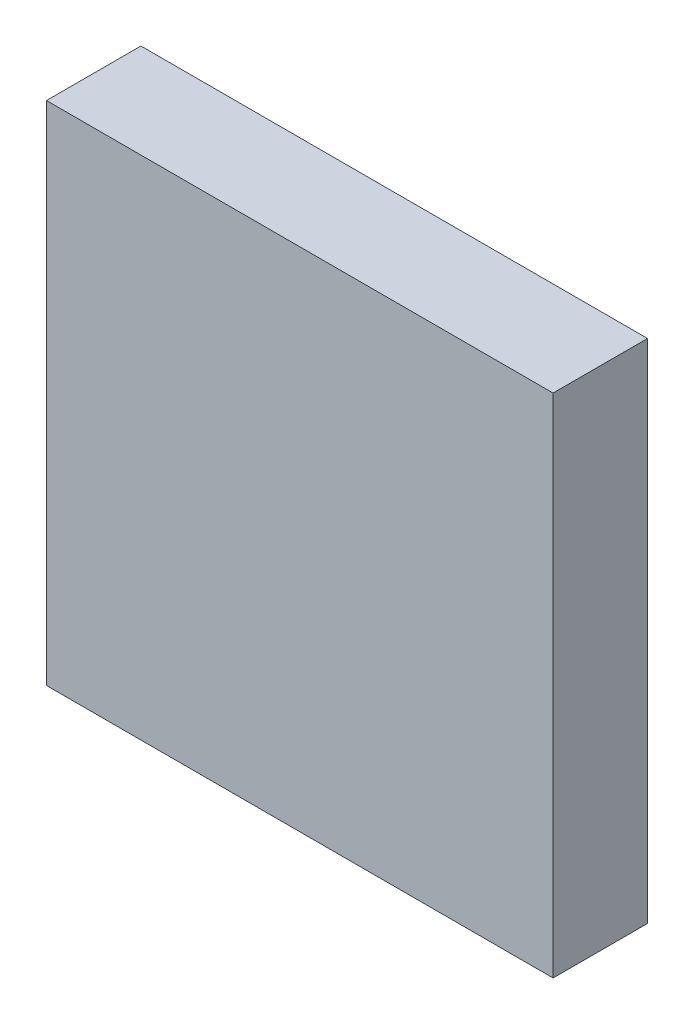
ISO-10303-21;
HEADER;
FILE_DESCRIPTION(('STEP AP214'),'2;1');
FILE_NAME('part.step','',(''),(''),'','','');
FILE_SCHEMA(('AUTOMOTIVE_DESIGN { 1 0 10303 214 1 1 1 1 }'));
ENDSEC;
DATA;
#1=APPLICATION_CONTEXT('core data for automotive mechanical design processes');
#2=APPLICATION_PROTOCOL_DEFINITION('international standard','automotive_design',2000,#1);
#3=PRODUCT_CONTEXT('',#1,'mechanical');
#4=PRODUCT('Part','Part','',(#3));
#5=PRODUCT_RELATED_PRODUCT_CATEGORY('part','',(#4));
#6=PRODUCT_DEFINITION_FORMATION('','',#4);
#7=PRODUCT_DEFINITION_CONTEXT('part definition',#1,'design');
#8=PRODUCT_DEFINITION('design','',#6,#7);
#9=PRODUCT_DEFINITION_SHAPE('','',#8);
#10=(LENGTH_UNIT() NAMED_UNIT(*) SI_UNIT(.MILLI.,.METRE.));
#11=(NAMED_UNIT(*) PLANE_ANGLE_UNIT() SI_UNIT($,.RADIAN.));
#12=(NAMED_UNIT(*) SI_UNIT($,.STERADIAN.) SOLID_ANGLE_UNIT());
#13=UNCERTAINTY_MEASURE_WITH_UNIT(LENGTH_MEASURE(1.E-05),#10,'distance_accuracy_value','');
#14=(GEOMETRIC_REPRESENTATION_CONTEXT(3) GLOBAL_UNCERTAINTY_ASSIGNED_CONTEXT((#13)) GLOBAL_UNIT_ASSIGNED_CONTEXT((#10,
#11,#12)) REPRESENTATION_CONTEXT('',''));
#15=CARTESIAN_POINT('',(0.,0.,0.));
#16=DIRECTION('',(0.,0.,1.));
#17=DIRECTION('',(1.,0.,0.));
#18=AXIS2_PLACEMENT_3D('',#15,#16,#17);
#19=CARTESIAN_POINT('',(-2.95,2.95,0.));
#20=DIRECTION('',(0.,1.,0.));
#21=DIRECTION('',(1.,0.,0.));
#22=AXIS2_PLACEMENT_3D('',#19,#20,#21);
#23=PLANE('',#22);
#24=DIRECTION('',(0.,0.,1.));
#25=VECTOR('',#24,1.);
#26=CARTESIAN_POINT('',(-2.95,2.95,0.));
#27=LINE('',#26,#25);
#28=CARTESIAN_POINT('',(-2.95,2.95,0.));
#29=VERTEX_POINT('',#28);
#30=CARTESIAN_POINT('',(-2.95,2.95,1.1));
#31=VERTEX_POINT('',#30);
#32=EDGE_CURVE('E11',#29,#31,#27,.T.);
#33=ORIENTED_EDGE('',*,*,#32,.T.);
#34=DIRECTION('',(1.,0.,0.));
#35=VECTOR('',#34,1.);
#36=CARTESIAN_POINT('',(-2.95,2.95,1.1));
#37=LINE('',#36,#35);
#38=CARTESIAN_POINT('',(2.95,2.95,1.1));
#39=VERTEX_POINT('',#38);
#40=EDGE_CURVE('E24',#31,#39,#37,.T.);
#41=ORIENTED_EDGE('',*,*,#40,.T.);
#42=DIRECTION('',(0.,0.,1.));
#43=VECTOR('',#42,1.);
#44=CARTESIAN_POINT('',(2.95,2.95,0.));
#45=LINE('',#44,#43);
#46=CARTESIAN_POINT('',(2.95,2.95,0.));
#47=VERTEX_POINT('',#46);
#48=EDGE_CURVE('E85',#47,#39,#45,.T.);
#49=ORIENTED_EDGE('',*,*,#48,.F.);
#50=DIRECTION('',(1.,0.,0.));
#51=VECTOR('',#50,1.);
#52=CARTESIAN_POINT('',(-2.95,2.95,0.));
#53=LINE('',#52,#51);
#54=EDGE_CURVE('E83',#29,#47,#53,.T.);
#55=ORIENTED_EDGE('',*,*,#54,.F.);
#56=EDGE_LOOP('',(#33,#41,#49,#55));
#57=FACE_BOUND('',#56,.T.);
#58=ADVANCED_FACE('F17',(#57),#23,.T.);
#59=CARTESIAN_POINT('',(2.95,2.95,0.));
#60=DIRECTION('',(1.,0.,0.));
#61=DIRECTION('',(0.,-1.,0.));
#62=AXIS2_PLACEMENT_3D('',#59,#60,#61);
#63=PLANE('',#62);
#64=ORIENTED_EDGE('',*,*,#48,.T.);
#65=DIRECTION('',(0.,-1.,0.));
#66=VECTOR('',#65,1.);
#67=CARTESIAN_POINT('',(2.95,2.95,1.1));
#68=LINE('',#67,#66);
#69=CARTESIAN_POINT('',(2.95,-2.95,1.1));
#70=VERTEX_POINT('',#69);
#71=EDGE_CURVE('E81',#39,#70,#68,.T.);
#72=ORIENTED_EDGE('',*,*,#71,.T.);
#73=DIRECTION('',(0.,0.,1.));
#74=VECTOR('',#73,1.);
#75=CARTESIAN_POINT('',(2.95,-2.95,0.));
#76=LINE('',#75,#74);
#77=CARTESIAN_POINT('',(2.95,-2.95,0.));
#78=VERTEX_POINT('',#77);
#79=EDGE_CURVE('E79',#78,#70,#76,.T.);
#80=ORIENTED_EDGE('',*,*,#79,.F.);
#81=DIRECTION('',(0.,-1.,0.));
#82=VECTOR('',#81,1.);
#83=CARTESIAN_POINT('',(2.95,2.95,0.));
#84=LINE('',#83,#82);
#85=EDGE_CURVE('E70',#47,#78,#84,.T.);
#86=ORIENTED_EDGE('',*,*,#85,.F.);
#87=EDGE_LOOP('',(#64,#72,#80,#86));
#88=FACE_BOUND('',#87,.T.);
#89=ADVANCED_FACE('F90',(#88),#63,.T.);
#90=CARTESIAN_POINT('',(2.95,-2.95,0.));
#91=DIRECTION('',(0.,-1.,0.));
#92=DIRECTION('',(-1.,0.,0.));
#93=AXIS2_PLACEMENT_3D('',#90,#91,#92);
#94=PLANE('',#93);
#95=ORIENTED_EDGE('',*,*,#79,.T.);
#96=DIRECTION('',(-1.,0.,0.));
#97=VECTOR('',#96,1.);
#98=CARTESIAN_POINT('',(2.95,-2.95,1.1));
#99=LINE('',#98,#97);
#100=CARTESIAN_POINT('',(-2.95,-2.95,1.1));
#101=VERTEX_POINT('',#100);
#102=EDGE_CURVE('E60',#70,#101,#99,.T.);
#103=ORIENTED_EDGE('',*,*,#102,.T.);
#104=DIRECTION('',(0.,0.,1.));
#105=VECTOR('',#104,1.);
#106=CARTESIAN_POINT('',(-2.95,-2.95,0.));
#107=LINE('',#106,#105);
#108=CARTESIAN_POINT('',(-2.95,-2.95,0.));
#109=VERTEX_POINT('',#108);
#110=EDGE_CURVE('E54',#109,#101,#107,.T.);
#111=ORIENTED_EDGE('',*,*,#110,.F.);
#112=DIRECTION('',(-1.,0.,0.));
#113=VECTOR('',#112,1.);
#114=CARTESIAN_POINT('',(2.95,-2.95,0.));
#115=LINE('',#114,#113);
#116=EDGE_CURVE('E58',#78,#109,#115,.T.);
#117=ORIENTED_EDGE('',*,*,#116,.F.);
#118=EDGE_LOOP('',(#95,#103,#111,#117));
#119=FACE_BOUND('',#118,.T.);
#120=ADVANCED_FACE('F57',(#119),#94,.T.);
#121=CARTESIAN_POINT('',(-2.95,-2.95,0.));
#122=DIRECTION('',(-1.,0.,0.));
#123=DIRECTION('',(0.,1.,0.));
#124=AXIS2_PLACEMENT_3D('',#121,#122,#123);
#125=PLANE('',#124);
#126=ORIENTED_EDGE('',*,*,#110,.T.);
#127=DIRECTION('',(0.,1.,0.));
#128=VECTOR('',#127,1.);
#129=CARTESIAN_POINT('',(-2.95,-2.95,1.1));
#130=LINE('',#129,#128);
#131=EDGE_CURVE('E71',#101,#31,#130,.T.);
#132=ORIENTED_EDGE('',*,*,#131,.T.);
#133=ORIENTED_EDGE('',*,*,#32,.F.);
#134=DIRECTION('',(0.,1.,0.));
#135=VECTOR('',#134,1.);
#136=CARTESIAN_POINT('',(-2.95,-2.95,0.));
#137=LINE('',#136,#135);
#138=EDGE_CURVE('E68',#109,#29,#137,.T.);
#139=ORIENTED_EDGE('',*,*,#138,.F.);
#140=EDGE_LOOP('',(#126,#132,#133,#139));
#141=FACE_BOUND('',#140,.T.);
#142=ADVANCED_FACE('F73',(#141),#125,.T.);
#143=CARTESIAN_POINT('',(0.,0.,0.));
#144=DIRECTION('',(0.,0.,-1.));
#145=DIRECTION('',(-1.,0.,0.));
#146=AXIS2_PLACEMENT_3D('',#143,#144,#145);
#147=PLANE('',#146);
#148=ORIENTED_EDGE('',*,*,#54,.T.);
#149=ORIENTED_EDGE('',*,*,#85,.T.);
#150=ORIENTED_EDGE('',*,*,#116,.T.);
#151=ORIENTED_EDGE('',*,*,#138,.T.);
#152=EDGE_LOOP('',(#148,#149,#150,#151));
#153=FACE_BOUND('',#152,.T.);
#154=ADVANCED_FACE('F67',(#153),#147,.T.);
#155=CARTESIAN_POINT('',(0.,0.,1.1));
#156=DIRECTION('',(0.,0.,-1.));
#157=DIRECTION('',(-1.,0.,0.));
#158=AXIS2_PLACEMENT_3D('',#155,#156,#157);
#159=PLANE('',#158);
#160=ORIENTED_EDGE('',*,*,#131,.F.);
#161=ORIENTED_EDGE('',*,*,#102,.F.);
#162=ORIENTED_EDGE('',*,*,#71,.F.);
#163=ORIENTED_EDGE('',*,*,#40,.F.);
#164=EDGE_LOOP('',(#160,#161,#162,#163));
#165=FACE_BOUND('',#164,.T.);
#166=ADVANCED_FACE('F91',(#165),#159,.F.);
#167=CLOSED_SHELL('',(#58,#89,#120,#142,#154,#166));
#168=MANIFOLD_SOLID_BREP('B1',#167);
#169=ADVANCED_BREP_SHAPE_REPRESENTATION('',(#18,#168),#14);
#170=SHAPE_DEFINITION_REPRESENTATION(#9,#169);
ENDSEC;
END-ISO-10303-21;
